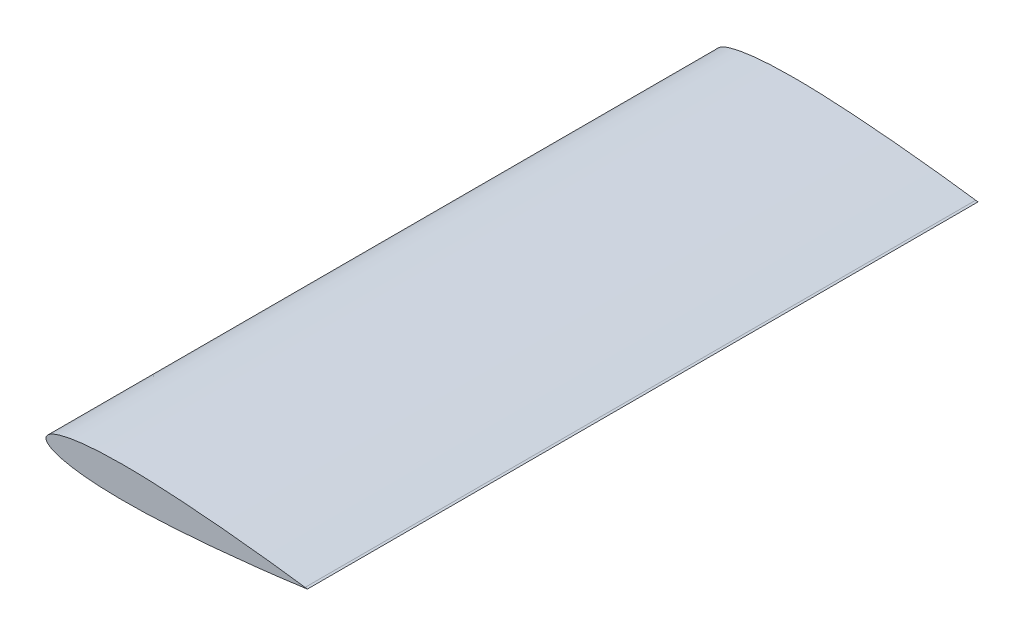
ISO-10303-21;
HEADER;
FILE_DESCRIPTION(('STEP AP214'),'2;1');
FILE_NAME('part.step','',(''),(''),'','','');
FILE_SCHEMA(('AUTOMOTIVE_DESIGN { 1 0 10303 214 1 1 1 1 }'));
ENDSEC;
DATA;
#1=APPLICATION_CONTEXT('core data for automotive mechanical design processes');
#2=APPLICATION_PROTOCOL_DEFINITION('international standard','automotive_design',2000,#1);
#3=PRODUCT_CONTEXT('',#1,'mechanical');
#4=PRODUCT('Part','Part','',(#3));
#5=PRODUCT_RELATED_PRODUCT_CATEGORY('part','',(#4));
#6=PRODUCT_DEFINITION_FORMATION('','',#4);
#7=PRODUCT_DEFINITION_CONTEXT('part definition',#1,'design');
#8=PRODUCT_DEFINITION('design','',#6,#7);
#9=PRODUCT_DEFINITION_SHAPE('','',#8);
#10=(LENGTH_UNIT() NAMED_UNIT(*) SI_UNIT(.MILLI.,.METRE.));
#11=(NAMED_UNIT(*) PLANE_ANGLE_UNIT() SI_UNIT($,.RADIAN.));
#12=(NAMED_UNIT(*) SI_UNIT($,.STERADIAN.) SOLID_ANGLE_UNIT());
#13=UNCERTAINTY_MEASURE_WITH_UNIT(LENGTH_MEASURE(1.E-05),#10,'distance_accuracy_value','');
#14=(GEOMETRIC_REPRESENTATION_CONTEXT(3) GLOBAL_UNCERTAINTY_ASSIGNED_CONTEXT((#13)) GLOBAL_UNIT_ASSIGNED_CONTEXT((#10,
#11,#12)) REPRESENTATION_CONTEXT('',''));
#15=CARTESIAN_POINT('',(0.,0.,0.));
#16=DIRECTION('',(0.,0.,1.));
#17=DIRECTION('',(1.,0.,0.));
#18=AXIS2_PLACEMENT_3D('',#15,#16,#17);
#19=CARTESIAN_POINT('',(170.,0.2142,220.));
#20=CARTESIAN_POINT('',(169.966912443167,0.21884178342881,220.));
#21=CARTESIAN_POINT('',(169.834644692626,0.237397346648998,220.));
#22=CARTESIAN_POINT('',(169.537331795498,0.279020665065549,220.));
#23=CARTESIAN_POINT('',(169.042585832032,0.348135674223796,220.));
#24=CARTESIAN_POINT('',(168.351558181787,0.444216312561043,220.));
#25=CARTESIAN_POINT('',(167.465863607256,0.566673358230626,220.));
#26=CARTESIAN_POINT('',(166.387572959382,0.714703342532084,220.));
#27=CARTESIAN_POINT('',(165.119198798467,0.887388894550173,220.));
#28=CARTESIAN_POINT('',(163.663704996892,1.08362012313545,220.));
#29=CARTESIAN_POINT('',(162.024491695186,1.30224034559511,220.));
#30=CARTESIAN_POINT('',(160.205384017945,1.54187410893821,220.));
#31=CARTESIAN_POINT('',(158.210635248145,1.80123418887197,220.));
#32=CARTESIAN_POINT('',(156.044891082148,2.0787269659307,220.));
#33=CARTESIAN_POINT('',(153.71322064677,2.37292946680883,220.));
#34=CARTESIAN_POINT('',(151.221064664167,2.68219486981575,220.));
#35=CARTESIAN_POINT('',(148.574250468494,3.00496436135929,220.));
#36=CARTESIAN_POINT('',(145.778948667419,3.33954592897408,220.));
#37=CARTESIAN_POINT('',(142.841695727965,3.68429103026742,220.));
#38=CARTESIAN_POINT('',(139.769352062879,4.03750588238121,220.));
#39=CARTESIAN_POINT('',(136.569099281887,4.39754793921502,220.));
#40=CARTESIAN_POINT('',(133.248399008198,4.7625877078686,220.));
#41=CARTESIAN_POINT('',(128.603273013246,5.26100862738338,220.));
#42=CARTESIAN_POINT('',(123.823466763859,5.75403376954087,220.));
#43=CARTESIAN_POINT('',(118.920129266171,6.2383594083857,220.));
#44=CARTESIAN_POINT('',(115.118534428376,6.60207832382136,220.));
#45=CARTESIAN_POINT('',(111.246602436613,6.95998968590994,220.));
#46=CARTESIAN_POINT('',(107.313366720264,7.31008497832594,220.));
#47=CARTESIAN_POINT('',(103.328024816819,7.65035105402389,220.));
#48=CARTESIAN_POINT('',(99.2998697975658,7.97872561623795,220.));
#49=CARTESIAN_POINT('',(95.238315945174,8.2930635941817,220.));
#50=CARTESIAN_POINT('',(91.1528463105317,8.59126159734276,220.));
#51=CARTESIAN_POINT('',(87.0530038553645,8.87108440283234,220.));
#52=CARTESIAN_POINT('',(82.9483587693756,9.13033499657408,220.));
#53=CARTESIAN_POINT('',(78.8484969023775,9.36680894168255,220.));
#54=CARTESIAN_POINT('',(74.7629918664027,9.57830934006077,220.));
#55=CARTESIAN_POINT('',(70.7013788256376,9.76270546440717,220.));
#56=CARTESIAN_POINT('',(66.6731402419177,9.91790438113259,220.));
#57=CARTESIAN_POINT('',(62.6876852679888,10.0419093961734,220.));
#58=CARTESIAN_POINT('',(58.7543225795428,10.1329093135724,220.));
#59=CARTESIAN_POINT('',(54.8822282305595,10.1891743223193,220.));
#60=CARTESIAN_POINT('',(51.0804434377128,10.2091798665476,220.));
#61=CARTESIAN_POINT('',(47.3578450793569,10.1916176936959,220.));
#62=CARTESIAN_POINT('',(43.7231276455227,10.1354376314847,220.));
#63=CARTESIAN_POINT('',(40.1847712378795,10.0397699942411,220.));
#64=CARTESIAN_POINT('',(36.7510333636057,9.90409201559413,220.));
#65=CARTESIAN_POINT('',(33.4299309562478,9.72815005665981,220.));
#66=CARTESIAN_POINT('',(30.2292183608837,9.51190480725317,220.));
#67=CARTESIAN_POINT('',(27.1563519847906,9.25571933543532,220.));
#68=CARTESIAN_POINT('',(24.218491950912,8.96018623538182,220.));
#69=CARTESIAN_POINT('',(21.4224887495192,8.6261278249922,220.));
#70=CARTESIAN_POINT('',(18.7748403583836,8.25473736186913,220.));
#71=CARTESIAN_POINT('',(16.2817050523988,7.84726864020827,220.));
#72=CARTESIAN_POINT('',(13.9488368880419,7.40539390358612,220.));
#73=CARTESIAN_POINT('',(11.7816287991002,6.93072086661183,220.));
#74=CARTESIAN_POINT('',(9.78501254199131,6.42519948579694,220.));
#75=CARTESIAN_POINT('',(7.96352031910696,5.89066494623834,220.));
#76=CARTESIAN_POINT('',(6.32116091501404,5.32913111249257,220.));
#77=CARTESIAN_POINT('',(4.86143972925095,4.74247923886823,220.));
#78=CARTESIAN_POINT('',(3.58725267555039,4.13245550480031,220.));
#79=CARTESIAN_POINT('',(2.50085891245511,3.50044270407342,220.));
#80=CARTESIAN_POINT('',(1.60384838874579,2.84715892220914,220.));
#81=CARTESIAN_POINT('',(0.897527198625635,2.17197997428238,220.));
#82=CARTESIAN_POINT('',(0.384180688691486,1.47253435462156,220.));
#83=CARTESIAN_POINT('',(0.0700404581883019,0.745786291706618,220.));
#84=CARTESIAN_POINT('',(-0.0341427843772273,0.,220.));
#85=CARTESIAN_POINT('',(0.0700404581882948,-0.745786291706588,220.));
#86=CARTESIAN_POINT('',(0.384180688691499,-1.47253435462159,220.));
#87=CARTESIAN_POINT('',(0.897527198625625,-2.17197997428236,220.));
#88=CARTESIAN_POINT('',(1.60384838874579,-2.84715892220914,220.));
#89=CARTESIAN_POINT('',(2.50085891245511,-3.50044270407342,220.));
#90=CARTESIAN_POINT('',(3.58725267555038,-4.13245550480031,220.));
#91=CARTESIAN_POINT('',(4.86143972925098,-4.74247923886825,220.));
#92=CARTESIAN_POINT('',(6.32116091501401,-5.32913111249256,220.));
#93=CARTESIAN_POINT('',(7.96352031910697,-5.89066494623835,220.));
#94=CARTESIAN_POINT('',(9.78501254199134,-6.42519948579695,220.));
#95=CARTESIAN_POINT('',(11.7816287991002,-6.93072086661182,220.));
#96=CARTESIAN_POINT('',(13.9488368880419,-7.40539390358612,220.));
#97=CARTESIAN_POINT('',(16.2817050523988,-7.84726864020828,220.));
#98=CARTESIAN_POINT('',(18.7748403583836,-8.25473736186913,220.));
#99=CARTESIAN_POINT('',(21.4224887495192,-8.6261278249922,220.));
#100=CARTESIAN_POINT('',(24.218491950912,-8.96018623538182,220.));
#101=CARTESIAN_POINT('',(27.1563519847907,-9.25571933543533,220.));
#102=CARTESIAN_POINT('',(30.2292183608837,-9.51190480725316,220.));
#103=CARTESIAN_POINT('',(33.4299309562478,-9.72815005665981,220.));
#104=CARTESIAN_POINT('',(36.7510333636057,-9.90409201559413,220.));
#105=CARTESIAN_POINT('',(40.1847712378794,-10.0397699942411,220.));
#106=CARTESIAN_POINT('',(43.7231276455227,-10.1354376314847,220.));
#107=CARTESIAN_POINT('',(47.3578450793569,-10.1916176936959,220.));
#108=CARTESIAN_POINT('',(51.0804434377129,-10.2091798665476,220.));
#109=CARTESIAN_POINT('',(54.8822282305594,-10.1891743223193,220.));
#110=CARTESIAN_POINT('',(58.7543225795428,-10.1329093135724,220.));
#111=CARTESIAN_POINT('',(62.6876852679887,-10.0419093961734,220.));
#112=CARTESIAN_POINT('',(66.6731402419177,-9.9179043811326,220.));
#113=CARTESIAN_POINT('',(70.7013788256375,-9.76270546440717,220.));
#114=CARTESIAN_POINT('',(74.7629918664028,-9.57830934006077,220.));
#115=CARTESIAN_POINT('',(78.8484969023775,-9.36680894168255,220.));
#116=CARTESIAN_POINT('',(82.9483587693756,-9.13033499657408,220.));
#117=CARTESIAN_POINT('',(87.0530038553645,-8.87108440283233,220.));
#118=CARTESIAN_POINT('',(91.1528463105317,-8.59126159734276,220.));
#119=CARTESIAN_POINT('',(95.238315945174,-8.2930635941817,220.));
#120=CARTESIAN_POINT('',(99.2998697975658,-7.97872561623794,220.));
#121=CARTESIAN_POINT('',(103.328024816819,-7.6503510540239,220.));
#122=CARTESIAN_POINT('',(107.313366720264,-7.31008497832594,220.));
#123=CARTESIAN_POINT('',(111.246602436613,-6.95998968590995,220.));
#124=CARTESIAN_POINT('',(116.361045787356,-6.48722379284067,220.));
#125=CARTESIAN_POINT('',(122.556207077656,-5.88475080961553,220.));
#126=CARTESIAN_POINT('',(128.603273013246,-5.26100862738338,220.));
#127=CARTESIAN_POINT('',(133.248399008198,-4.7625877078686,220.));
#128=CARTESIAN_POINT('',(136.569099281887,-4.39754793921502,220.));
#129=CARTESIAN_POINT('',(139.769352062879,-4.03750588238121,220.));
#130=CARTESIAN_POINT('',(142.841695727965,-3.68429103026741,220.));
#131=CARTESIAN_POINT('',(145.778948667419,-3.33954592897408,220.));
#132=CARTESIAN_POINT('',(148.574250468494,-3.00496436135929,220.));
#133=CARTESIAN_POINT('',(151.221064664167,-2.68219486981575,220.));
#134=CARTESIAN_POINT('',(153.71322064677,-2.37292946680883,220.));
#135=CARTESIAN_POINT('',(156.044891082148,-2.0787269659307,220.));
#136=CARTESIAN_POINT('',(158.210635248145,-1.80123418887196,220.));
#137=CARTESIAN_POINT('',(160.205384017945,-1.54187410893821,220.));
#138=CARTESIAN_POINT('',(162.024491695186,-1.3022403455951,220.));
#139=CARTESIAN_POINT('',(163.663704996891,-1.08362012313546,220.));
#140=CARTESIAN_POINT('',(165.119198798467,-0.887388894550166,220.));
#141=CARTESIAN_POINT('',(166.387572959382,-0.71470334253209,220.));
#142=CARTESIAN_POINT('',(167.465863607256,-0.566673358230623,220.));
#143=CARTESIAN_POINT('',(168.351558181787,-0.444216312561048,220.));
#144=CARTESIAN_POINT('',(169.042585832032,-0.348135674223798,220.));
#145=CARTESIAN_POINT('',(169.537331795498,-0.279020665065538,220.));
#146=CARTESIAN_POINT('',(169.834644692626,-0.237397346649009,220.));
#147=CARTESIAN_POINT('',(169.966912443167,-0.218841783428811,220.));
#148=CARTESIAN_POINT('',(170.,-0.2142,220.));
#149=B_SPLINE_CURVE_WITH_KNOTS('',3,(#19,#20,#21,#22,#23,#24,#25,#26,#27,#28,#29,#30,#31,#32,
#33,#34,#35,#36,#37,#38,#39,#40,#41,#42,#43,#44,#45,#46,#47,#48,#49,#50,#51,#52,#53,#54,#55,#56,
#57,#58,#59,#60,#61,#62,#63,#64,#65,#66,#67,#68,#69,#70,#71,#72,#73,#74,#75,#76,#77,#78,#79,#80,
#81,#82,#83,#84,#85,#86,#87,#88,#89,#90,#91,#92,#93,#94,#95,#96,#97,#98,#99,#100,#101,#102,#103,
#104,#105,#106,#107,#108,#109,#110,#111,#112,#113,#114,#115,#116,#117,#118,#119,#120,#121,#122,
#123,#124,#125,#126,#127,#128,#129,#130,#131,#132,#133,#134,#135,#136,#137,#138,#139,#140,#141,
#142,#143,#144,#145,#146,#147,#148),.UNSPECIFIED.,.F.,.F.,(4,1,1,1,1,1,1,1,1,1,1,1,1,1,1,1,1,1,
1,1,1,1,1,1,1,1,1,1,1,1,1,1,1,1,1,1,1,1,1,1,1,1,1,1,1,1,1,1,1,1,1,1,1,1,1,1,1,1,1,1,1,1,1,1,1,1,
1,1,1,1,1,1,1,1,1,1,1,1,1,1,1,1,1,1,1,1,1,1,1,1,1,1,1,1,1,1,1,1,1,1,1,1,1,1,1,1,1,1,1,1,1,1,1,1,
1,1,1,1,1,1,1,1,1,1,1,1,1,4),(0.,0.000289146012208095,0.00115586329945769,0.00259805874790931,
0.0046122887657111,0.0071935929733987,0.0103358351467946,0.0140314129150334,0.018271453485421,
0.0230457375913408,0.0283428821695205,0.0341501370920947,0.0404537305224403,0.0472385925337366,
0.0544885550062153,0.0621864377849775,0.0703139762203531,0.0788519427142012,0.0877800920894453,
0.0970773621435758,0.106721846803723,0.116690748252035,0.137507310724012,0.14830591335894,
0.159331010090231,0.170556758010199,0.181956676151837,0.193504010213206,0.205171586378334,
0.216932159347369,0.228757986521069,0.240621460081088,0.252494885661238,0.26435049076449,
0.276160731135953,0.287898257272151,0.299535924833915,0.311046958730048,0.322405016007326,
0.33358424112908,0.34455942720365,0.355305876694046,0.365799652157998,0.376017632735469,
0.385937515259466,0.395537820767709,0.404798053904225,0.413698796542159,0.422221689314506,
0.430349461124564,0.4380661515799,0.445357166330781,0.452209423283855,0.458611485415412,
0.464554009305641,0.470029937535629,0.475035084210348,0.479569178588025,0.483636915774579,
0.487250221980046,0.490431492848229,0.493218846943701,0.495674070493982,0.497891229124202,0.5,
0.502108770875798,0.504325929506018,0.506781153056298,0.509568507151771,0.512749778019954,
0.516363084225421,0.520430821411975,0.524964915789652,0.52997006246437,0.535445990694358,
0.541388514584587,0.547790576716144,0.554642833669218,0.5619338484201,0.569650538875436,
0.577778310685494,0.586301203457841,0.595201946095775,0.604462179232291,0.614062484740533,
0.623982367264531,0.634200347842002,0.644694123305954,0.65544057279635,0.66641575887092,
0.677594983992674,0.688953041269952,0.700464075166084,0.712101742727849,0.723839268864047,
0.73564950923551,0.747505114338762,0.759378539918911,0.77124201347893,0.783067840652631,
0.794828413621665,0.806495989786793,0.818043323848163,0.829443241989801,0.840668989909768,
0.862492689275988,0.883309251747965,0.893278153196277,0.902922637856424,0.912219907910554,
0.921148057285798,0.929686023779646,0.937813562215022,0.945511444993784,0.952761407466263,
0.95954626947756,0.965849862907905,0.971657117830479,0.976954262408659,0.981728546514579,
0.985968587084967,0.989664164853206,0.992806407026601,0.995387711234289,0.997401941252091,
0.998844136700542,0.999710853987792,1.),.UNSPECIFIED.);
#150=DIRECTION('',(0.,0.,-1.));
#151=VECTOR('',#150,1.);
#152=SURFACE_OF_LINEAR_EXTRUSION('',#149,#151);
#153=CARTESIAN_POINT('',(170.,0.2142,-220.));
#154=CARTESIAN_POINT('',(169.966912443167,0.21884178342881,-220.));
#155=CARTESIAN_POINT('',(169.834644692626,0.237397346648998,-220.));
#156=CARTESIAN_POINT('',(169.537331795498,0.279020665065549,-220.));
#157=CARTESIAN_POINT('',(169.042585832032,0.348135674223796,-220.));
#158=CARTESIAN_POINT('',(168.351558181787,0.444216312561043,-220.));
#159=CARTESIAN_POINT('',(167.465863607256,0.566673358230626,-220.));
#160=CARTESIAN_POINT('',(166.387572959382,0.714703342532084,-220.));
#161=CARTESIAN_POINT('',(165.119198798467,0.887388894550173,-220.));
#162=CARTESIAN_POINT('',(163.663704996892,1.08362012313545,-220.));
#163=CARTESIAN_POINT('',(162.024491695186,1.30224034559511,-220.));
#164=CARTESIAN_POINT('',(160.205384017945,1.54187410893821,-220.));
#165=CARTESIAN_POINT('',(158.210635248145,1.80123418887197,-220.));
#166=CARTESIAN_POINT('',(156.044891082148,2.0787269659307,-220.));
#167=CARTESIAN_POINT('',(153.71322064677,2.37292946680883,-220.));
#168=CARTESIAN_POINT('',(151.221064664167,2.68219486981575,-220.));
#169=CARTESIAN_POINT('',(148.574250468494,3.00496436135929,-220.));
#170=CARTESIAN_POINT('',(145.778948667419,3.33954592897408,-220.));
#171=CARTESIAN_POINT('',(142.841695727965,3.68429103026742,-220.));
#172=CARTESIAN_POINT('',(139.769352062879,4.03750588238121,-220.));
#173=CARTESIAN_POINT('',(136.569099281887,4.39754793921502,-220.));
#174=CARTESIAN_POINT('',(133.248399008198,4.7625877078686,-220.));
#175=CARTESIAN_POINT('',(128.603273013246,5.26100862738338,-220.));
#176=CARTESIAN_POINT('',(123.823466763859,5.75403376954087,-220.));
#177=CARTESIAN_POINT('',(118.920129266171,6.2383594083857,-220.));
#178=CARTESIAN_POINT('',(115.118534428376,6.60207832382136,-220.));
#179=CARTESIAN_POINT('',(111.246602436613,6.95998968590994,-220.));
#180=CARTESIAN_POINT('',(107.313366720264,7.31008497832594,-220.));
#181=CARTESIAN_POINT('',(103.328024816819,7.65035105402389,-220.));
#182=CARTESIAN_POINT('',(99.2998697975658,7.97872561623795,-220.));
#183=CARTESIAN_POINT('',(95.238315945174,8.2930635941817,-220.));
#184=CARTESIAN_POINT('',(91.1528463105317,8.59126159734276,-220.));
#185=CARTESIAN_POINT('',(87.0530038553645,8.87108440283234,-220.));
#186=CARTESIAN_POINT('',(82.9483587693756,9.13033499657408,-220.));
#187=CARTESIAN_POINT('',(78.8484969023775,9.36680894168255,-220.));
#188=CARTESIAN_POINT('',(74.7629918664027,9.57830934006077,-220.));
#189=CARTESIAN_POINT('',(70.7013788256376,9.76270546440717,-220.));
#190=CARTESIAN_POINT('',(66.6731402419177,9.91790438113259,-220.));
#191=CARTESIAN_POINT('',(62.6876852679888,10.0419093961734,-220.));
#192=CARTESIAN_POINT('',(58.7543225795428,10.1329093135724,-220.));
#193=CARTESIAN_POINT('',(54.8822282305595,10.1891743223193,-220.));
#194=CARTESIAN_POINT('',(51.0804434377128,10.2091798665476,-220.));
#195=CARTESIAN_POINT('',(47.3578450793569,10.1916176936959,-220.));
#196=CARTESIAN_POINT('',(43.7231276455227,10.1354376314847,-220.));
#197=CARTESIAN_POINT('',(40.1847712378795,10.0397699942411,-220.));
#198=CARTESIAN_POINT('',(36.7510333636057,9.90409201559413,-220.));
#199=CARTESIAN_POINT('',(33.4299309562478,9.72815005665981,-220.));
#200=CARTESIAN_POINT('',(30.2292183608837,9.51190480725317,-220.));
#201=CARTESIAN_POINT('',(27.1563519847906,9.25571933543532,-220.));
#202=CARTESIAN_POINT('',(24.218491950912,8.96018623538182,-220.));
#203=CARTESIAN_POINT('',(21.4224887495192,8.6261278249922,-220.));
#204=CARTESIAN_POINT('',(18.7748403583836,8.25473736186913,-220.));
#205=CARTESIAN_POINT('',(16.2817050523988,7.84726864020827,-220.));
#206=CARTESIAN_POINT('',(13.9488368880419,7.40539390358612,-220.));
#207=CARTESIAN_POINT('',(11.7816287991002,6.93072086661183,-220.));
#208=CARTESIAN_POINT('',(9.78501254199131,6.42519948579694,-220.));
#209=CARTESIAN_POINT('',(7.96352031910696,5.89066494623834,-220.));
#210=CARTESIAN_POINT('',(6.32116091501404,5.32913111249257,-220.));
#211=CARTESIAN_POINT('',(4.86143972925095,4.74247923886823,-220.));
#212=CARTESIAN_POINT('',(3.58725267555039,4.13245550480031,-220.));
#213=CARTESIAN_POINT('',(2.50085891245511,3.50044270407342,-220.));
#214=CARTESIAN_POINT('',(1.60384838874579,2.84715892220914,-220.));
#215=CARTESIAN_POINT('',(0.897527198625635,2.17197997428238,-220.));
#216=CARTESIAN_POINT('',(0.384180688691486,1.47253435462156,-220.));
#217=CARTESIAN_POINT('',(0.0700404581883019,0.745786291706618,-220.));
#218=CARTESIAN_POINT('',(-0.0341427843772273,0.,-220.));
#219=CARTESIAN_POINT('',(0.0700404581882948,-0.745786291706588,-220.));
#220=CARTESIAN_POINT('',(0.384180688691499,-1.47253435462159,-220.));
#221=CARTESIAN_POINT('',(0.897527198625625,-2.17197997428236,-220.));
#222=CARTESIAN_POINT('',(1.60384838874579,-2.84715892220914,-220.));
#223=CARTESIAN_POINT('',(2.50085891245511,-3.50044270407342,-220.));
#224=CARTESIAN_POINT('',(3.58725267555038,-4.13245550480031,-220.));
#225=CARTESIAN_POINT('',(4.86143972925098,-4.74247923886825,-220.));
#226=CARTESIAN_POINT('',(6.32116091501401,-5.32913111249256,-220.));
#227=CARTESIAN_POINT('',(7.96352031910697,-5.89066494623835,-220.));
#228=CARTESIAN_POINT('',(9.78501254199134,-6.42519948579695,-220.));
#229=CARTESIAN_POINT('',(11.7816287991002,-6.93072086661182,-220.));
#230=CARTESIAN_POINT('',(13.9488368880419,-7.40539390358612,-220.));
#231=CARTESIAN_POINT('',(16.2817050523988,-7.84726864020828,-220.));
#232=CARTESIAN_POINT('',(18.7748403583836,-8.25473736186913,-220.));
#233=CARTESIAN_POINT('',(21.4224887495192,-8.6261278249922,-220.));
#234=CARTESIAN_POINT('',(24.218491950912,-8.96018623538182,-220.));
#235=CARTESIAN_POINT('',(27.1563519847907,-9.25571933543533,-220.));
#236=CARTESIAN_POINT('',(30.2292183608837,-9.51190480725316,-220.));
#237=CARTESIAN_POINT('',(33.4299309562478,-9.72815005665981,-220.));
#238=CARTESIAN_POINT('',(36.7510333636057,-9.90409201559413,-220.));
#239=CARTESIAN_POINT('',(40.1847712378794,-10.0397699942411,-220.));
#240=CARTESIAN_POINT('',(43.7231276455227,-10.1354376314847,-220.));
#241=CARTESIAN_POINT('',(47.3578450793569,-10.1916176936959,-220.));
#242=CARTESIAN_POINT('',(51.0804434377129,-10.2091798665476,-220.));
#243=CARTESIAN_POINT('',(54.8822282305594,-10.1891743223193,-220.));
#244=CARTESIAN_POINT('',(58.7543225795428,-10.1329093135724,-220.));
#245=CARTESIAN_POINT('',(62.6876852679887,-10.0419093961734,-220.));
#246=CARTESIAN_POINT('',(66.6731402419177,-9.9179043811326,-220.));
#247=CARTESIAN_POINT('',(70.7013788256375,-9.76270546440717,-220.));
#248=CARTESIAN_POINT('',(74.7629918664028,-9.57830934006077,-220.));
#249=CARTESIAN_POINT('',(78.8484969023775,-9.36680894168255,-220.));
#250=CARTESIAN_POINT('',(82.9483587693756,-9.13033499657408,-220.));
#251=CARTESIAN_POINT('',(87.0530038553645,-8.87108440283233,-220.));
#252=CARTESIAN_POINT('',(91.1528463105317,-8.59126159734276,-220.));
#253=CARTESIAN_POINT('',(95.238315945174,-8.2930635941817,-220.));
#254=CARTESIAN_POINT('',(99.2998697975658,-7.97872561623794,-220.));
#255=CARTESIAN_POINT('',(103.328024816819,-7.6503510540239,-220.));
#256=CARTESIAN_POINT('',(107.313366720264,-7.31008497832594,-220.));
#257=CARTESIAN_POINT('',(111.246602436613,-6.95998968590995,-220.));
#258=CARTESIAN_POINT('',(116.361045787356,-6.48722379284067,-220.));
#259=CARTESIAN_POINT('',(122.556207077656,-5.88475080961553,-220.));
#260=CARTESIAN_POINT('',(128.603273013246,-5.26100862738338,-220.));
#261=CARTESIAN_POINT('',(133.248399008198,-4.7625877078686,-220.));
#262=CARTESIAN_POINT('',(136.569099281887,-4.39754793921502,-220.));
#263=CARTESIAN_POINT('',(139.769352062879,-4.03750588238121,-220.));
#264=CARTESIAN_POINT('',(142.841695727965,-3.68429103026741,-220.));
#265=CARTESIAN_POINT('',(145.778948667419,-3.33954592897408,-220.));
#266=CARTESIAN_POINT('',(148.574250468494,-3.00496436135929,-220.));
#267=CARTESIAN_POINT('',(151.221064664167,-2.68219486981575,-220.));
#268=CARTESIAN_POINT('',(153.71322064677,-2.37292946680883,-220.));
#269=CARTESIAN_POINT('',(156.044891082148,-2.0787269659307,-220.));
#270=CARTESIAN_POINT('',(158.210635248145,-1.80123418887196,-220.));
#271=CARTESIAN_POINT('',(160.205384017945,-1.54187410893821,-220.));
#272=CARTESIAN_POINT('',(162.024491695186,-1.3022403455951,-220.));
#273=CARTESIAN_POINT('',(163.663704996891,-1.08362012313546,-220.));
#274=CARTESIAN_POINT('',(165.119198798467,-0.887388894550166,-220.));
#275=CARTESIAN_POINT('',(166.387572959382,-0.71470334253209,-220.));
#276=CARTESIAN_POINT('',(167.465863607256,-0.566673358230623,-220.));
#277=CARTESIAN_POINT('',(168.351558181787,-0.444216312561048,-220.));
#278=CARTESIAN_POINT('',(169.042585832032,-0.348135674223798,-220.));
#279=CARTESIAN_POINT('',(169.537331795498,-0.279020665065538,-220.));
#280=CARTESIAN_POINT('',(169.834644692626,-0.237397346649009,-220.));
#281=CARTESIAN_POINT('',(169.966912443167,-0.218841783428811,-220.));
#282=CARTESIAN_POINT('',(170.,-0.2142,-220.));
#283=B_SPLINE_CURVE_WITH_KNOTS('',3,(#153,#154,#155,#156,#157,#158,#159,#160,#161,#162,#163,
#164,#165,#166,#167,#168,#169,#170,#171,#172,#173,#174,#175,#176,#177,#178,#179,#180,#181,#182,
#183,#184,#185,#186,#187,#188,#189,#190,#191,#192,#193,#194,#195,#196,#197,#198,#199,#200,#201,
#202,#203,#204,#205,#206,#207,#208,#209,#210,#211,#212,#213,#214,#215,#216,#217,#218,#219,#220,
#221,#222,#223,#224,#225,#226,#227,#228,#229,#230,#231,#232,#233,#234,#235,#236,#237,#238,#239,
#240,#241,#242,#243,#244,#245,#246,#247,#248,#249,#250,#251,#252,#253,#254,#255,#256,#257,#258,
#259,#260,#261,#262,#263,#264,#265,#266,#267,#268,#269,#270,#271,#272,#273,#274,#275,#276,#277,
#278,#279,#280,#281,#282),.UNSPECIFIED.,.F.,.F.,(4,1,1,1,1,1,1,1,1,1,1,1,1,1,1,1,1,1,1,1,1,1,1,
1,1,1,1,1,1,1,1,1,1,1,1,1,1,1,1,1,1,1,1,1,1,1,1,1,1,1,1,1,1,1,1,1,1,1,1,1,1,1,1,1,1,1,1,1,1,1,1,
1,1,1,1,1,1,1,1,1,1,1,1,1,1,1,1,1,1,1,1,1,1,1,1,1,1,1,1,1,1,1,1,1,1,1,1,1,1,1,1,1,1,1,1,1,1,1,1,
1,1,1,1,1,1,1,1,4),(0.,0.000289146012208095,0.00115586329945769,0.00259805874790931,
0.0046122887657111,0.0071935929733987,0.0103358351467946,0.0140314129150334,0.018271453485421,
0.0230457375913408,0.0283428821695205,0.0341501370920947,0.0404537305224403,0.0472385925337366,
0.0544885550062153,0.0621864377849775,0.0703139762203531,0.0788519427142012,0.0877800920894453,
0.0970773621435758,0.106721846803723,0.116690748252035,0.137507310724012,0.14830591335894,
0.159331010090231,0.170556758010199,0.181956676151837,0.193504010213206,0.205171586378334,
0.216932159347369,0.228757986521069,0.240621460081088,0.252494885661238,0.26435049076449,
0.276160731135953,0.287898257272151,0.299535924833915,0.311046958730048,0.322405016007326,
0.33358424112908,0.34455942720365,0.355305876694046,0.365799652157998,0.376017632735469,
0.385937515259466,0.395537820767709,0.404798053904225,0.413698796542159,0.422221689314506,
0.430349461124564,0.4380661515799,0.445357166330781,0.452209423283855,0.458611485415412,
0.464554009305641,0.470029937535629,0.475035084210348,0.479569178588025,0.483636915774579,
0.487250221980046,0.490431492848229,0.493218846943701,0.495674070493982,0.497891229124202,0.5,
0.502108770875798,0.504325929506018,0.506781153056298,0.509568507151771,0.512749778019954,
0.516363084225421,0.520430821411975,0.524964915789652,0.52997006246437,0.535445990694358,
0.541388514584587,0.547790576716144,0.554642833669218,0.5619338484201,0.569650538875436,
0.577778310685494,0.586301203457841,0.595201946095775,0.604462179232291,0.614062484740533,
0.623982367264531,0.634200347842002,0.644694123305954,0.65544057279635,0.66641575887092,
0.677594983992674,0.688953041269952,0.700464075166084,0.712101742727849,0.723839268864047,
0.73564950923551,0.747505114338762,0.759378539918911,0.77124201347893,0.783067840652631,
0.794828413621665,0.806495989786793,0.818043323848163,0.829443241989801,0.840668989909768,
0.862492689275988,0.883309251747965,0.893278153196277,0.902922637856424,0.912219907910554,
0.921148057285798,0.929686023779646,0.937813562215022,0.945511444993784,0.952761407466263,
0.95954626947756,0.965849862907905,0.971657117830479,0.976954262408659,0.981728546514579,
0.985968587084967,0.989664164853206,0.992806407026601,0.995387711234289,0.997401941252091,
0.998844136700542,0.999710853987792,1.),.UNSPECIFIED.);
#284=CARTESIAN_POINT('',(170.,0.2142,-220.));
#285=VERTEX_POINT('',#284);
#286=CARTESIAN_POINT('',(170.,-0.2142,-220.));
#287=VERTEX_POINT('',#286);
#288=EDGE_CURVE('E92',#285,#287,#283,.T.);
#289=ORIENTED_EDGE('',*,*,#288,.T.);
#290=DIRECTION('',(0.,0.,-1.));
#291=VECTOR('',#290,1.);
#292=CARTESIAN_POINT('',(170.,-0.2142,220.));
#293=LINE('',#292,#291);
#294=CARTESIAN_POINT('',(170.,-0.2142,220.));
#295=VERTEX_POINT('',#294);
#296=EDGE_CURVE('E11',#295,#287,#293,.T.);
#297=ORIENTED_EDGE('',*,*,#296,.F.);
#298=CARTESIAN_POINT('',(170.,0.2142,220.));
#299=VERTEX_POINT('',#298);
#300=EDGE_CURVE('E85',#299,#295,#149,.T.);
#301=ORIENTED_EDGE('',*,*,#300,.F.);
#302=DIRECTION('',(0.,0.,-1.));
#303=VECTOR('',#302,1.);
#304=CARTESIAN_POINT('',(170.,0.2142,220.));
#305=LINE('',#304,#303);
#306=EDGE_CURVE('E93',#299,#285,#305,.T.);
#307=ORIENTED_EDGE('',*,*,#306,.T.);
#308=EDGE_LOOP('',(#289,#297,#301,#307));
#309=FACE_BOUND('',#308,.T.);
#310=ADVANCED_FACE('F42',(#309),#152,.F.);
#311=CARTESIAN_POINT('',(170.,-0.2142,220.));
#312=DIRECTION('',(-0.138927453634948,0.990302561153161,0.));
#313=DIRECTION('',(-0.990302561153161,-0.138927453634948,0.));
#314=AXIS2_PLACEMENT_3D('',#311,#312,#313);
#315=PLANE('',#314);
#316=DIRECTION('',(0.990302561153161,0.138927453634948,0.));
#317=VECTOR('',#316,1.);
#318=CARTESIAN_POINT('',(170.,-0.2142,-220.));
#319=LINE('',#318,#317);
#320=CARTESIAN_POINT('',(171.526860264469,0.,-220.));
#321=VERTEX_POINT('',#320);
#322=EDGE_CURVE('E72',#287,#321,#319,.T.);
#323=ORIENTED_EDGE('',*,*,#322,.T.);
#324=DIRECTION('',(0.,0.,-1.));
#325=VECTOR('',#324,1.);
#326=CARTESIAN_POINT('',(171.526860264469,0.,220.));
#327=LINE('',#326,#325);
#328=CARTESIAN_POINT('',(171.526860264469,0.,220.));
#329=VERTEX_POINT('',#328);
#330=EDGE_CURVE('E52',#329,#321,#327,.T.);
#331=ORIENTED_EDGE('',*,*,#330,.F.);
#332=DIRECTION('',(0.990302561153161,0.138927453634948,0.));
#333=VECTOR('',#332,1.);
#334=CARTESIAN_POINT('',(170.,-0.2142,220.));
#335=LINE('',#334,#333);
#336=EDGE_CURVE('E80',#295,#329,#335,.T.);
#337=ORIENTED_EDGE('',*,*,#336,.F.);
#338=ORIENTED_EDGE('',*,*,#296,.T.);
#339=EDGE_LOOP('',(#323,#331,#337,#338));
#340=FACE_BOUND('',#339,.T.);
#341=ADVANCED_FACE('F81',(#340),#315,.F.);
#342=CARTESIAN_POINT('',(170.,0.2142,220.));
#343=DIRECTION('',(-0.138927453634944,-0.990302561153161,0.));
#344=DIRECTION('',(0.990302561153161,-0.138927453634944,0.));
#345=AXIS2_PLACEMENT_3D('',#342,#343,#344);
#346=PLANE('',#345);
#347=DIRECTION('',(-0.990302561153161,0.138927453634944,0.));
#348=VECTOR('',#347,1.);
#349=CARTESIAN_POINT('',(170.,0.2142,-220.));
#350=LINE('',#349,#348);
#351=EDGE_CURVE('E77',#321,#285,#350,.T.);
#352=ORIENTED_EDGE('',*,*,#351,.T.);
#353=ORIENTED_EDGE('',*,*,#306,.F.);
#354=DIRECTION('',(-0.990302561153161,0.138927453634944,0.));
#355=VECTOR('',#354,1.);
#356=CARTESIAN_POINT('',(170.,0.2142,220.));
#357=LINE('',#356,#355);
#358=EDGE_CURVE('E60',#329,#299,#357,.T.);
#359=ORIENTED_EDGE('',*,*,#358,.F.);
#360=ORIENTED_EDGE('',*,*,#330,.T.);
#361=EDGE_LOOP('',(#352,#353,#359,#360));
#362=FACE_BOUND('',#361,.T.);
#363=ADVANCED_FACE('F110',(#362),#346,.F.);
#364=CARTESIAN_POINT('',(0.,0.,220.));
#365=DIRECTION('',(0.,0.,-1.));
#366=DIRECTION('',(-1.,0.,0.));
#367=AXIS2_PLACEMENT_3D('',#364,#365,#366);
#368=PLANE('',#367);
#369=ORIENTED_EDGE('',*,*,#300,.T.);
#370=ORIENTED_EDGE('',*,*,#336,.T.);
#371=ORIENTED_EDGE('',*,*,#358,.T.);
#372=EDGE_LOOP('',(#369,#370,#371));
#373=FACE_BOUND('',#372,.T.);
#374=ADVANCED_FACE('F88',(#373),#368,.F.);
#375=CARTESIAN_POINT('',(0.,0.,-220.));
#376=DIRECTION('',(0.,0.,-1.));
#377=DIRECTION('',(-1.,0.,0.));
#378=AXIS2_PLACEMENT_3D('',#375,#376,#377);
#379=PLANE('',#378);
#380=ORIENTED_EDGE('',*,*,#288,.F.);
#381=ORIENTED_EDGE('',*,*,#351,.F.);
#382=ORIENTED_EDGE('',*,*,#322,.F.);
#383=EDGE_LOOP('',(#380,#381,#382));
#384=FACE_BOUND('',#383,.T.);
#385=ADVANCED_FACE('F111',(#384),#379,.T.);
#386=CLOSED_SHELL('',(#310,#341,#363,#374,#385));
#387=MANIFOLD_SOLID_BREP('B2',#386);
#388=ADVANCED_BREP_SHAPE_REPRESENTATION('',(#18,#387),#14);
#389=SHAPE_DEFINITION_REPRESENTATION(#9,#388);
ENDSEC;
END-ISO-10303-21;
